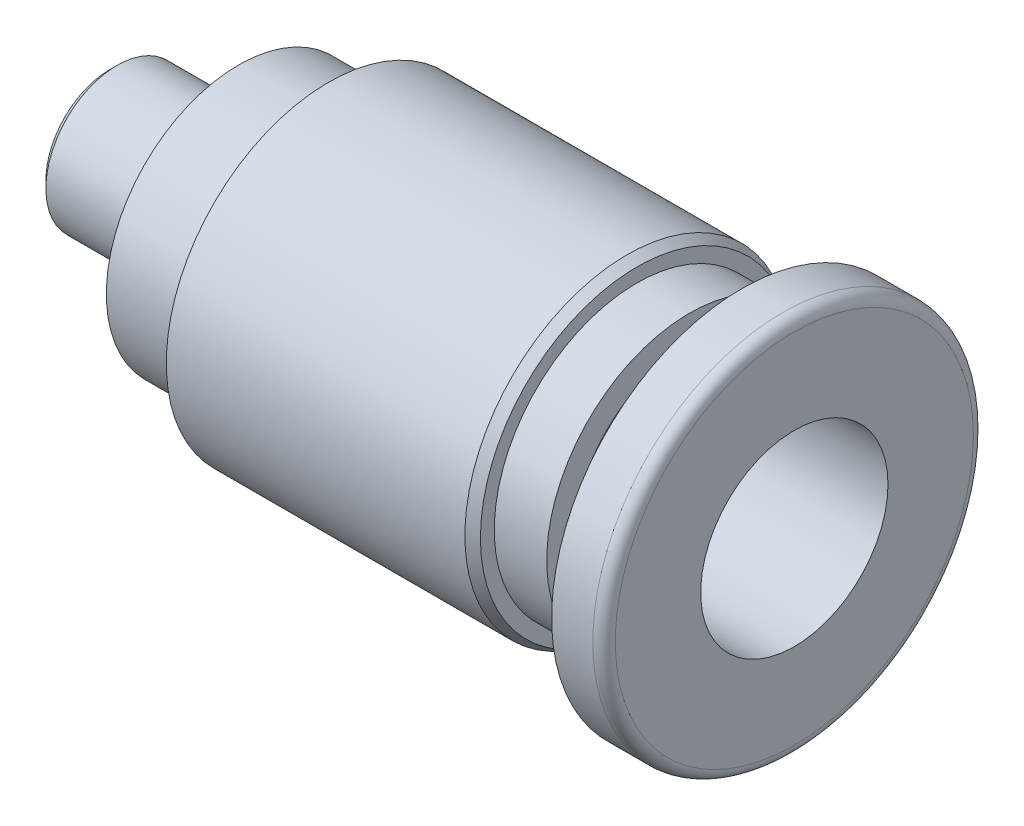
ISO-10303-21;
HEADER;
FILE_DESCRIPTION(('STEP AP214'),'2;1');
FILE_NAME('part.step','',(''),(''),'','','');
FILE_SCHEMA(('AUTOMOTIVE_DESIGN { 1 0 10303 214 1 1 1 1 }'));
ENDSEC;
DATA;
#1=APPLICATION_CONTEXT('core data for automotive mechanical design processes');
#2=APPLICATION_PROTOCOL_DEFINITION('international standard','automotive_design',2000,#1);
#3=PRODUCT_CONTEXT('',#1,'mechanical');
#4=PRODUCT('Part','Part','',(#3));
#5=PRODUCT_RELATED_PRODUCT_CATEGORY('part','',(#4));
#6=PRODUCT_DEFINITION_FORMATION('','',#4);
#7=PRODUCT_DEFINITION_CONTEXT('part definition',#1,'design');
#8=PRODUCT_DEFINITION('design','',#6,#7);
#9=PRODUCT_DEFINITION_SHAPE('','',#8);
#10=(LENGTH_UNIT() NAMED_UNIT(*) SI_UNIT(.MILLI.,.METRE.));
#11=(NAMED_UNIT(*) PLANE_ANGLE_UNIT() SI_UNIT($,.RADIAN.));
#12=(NAMED_UNIT(*) SI_UNIT($,.STERADIAN.) SOLID_ANGLE_UNIT());
#13=UNCERTAINTY_MEASURE_WITH_UNIT(LENGTH_MEASURE(1.E-05),#10,'distance_accuracy_value','');
#14=(GEOMETRIC_REPRESENTATION_CONTEXT(3) GLOBAL_UNCERTAINTY_ASSIGNED_CONTEXT((#13)) GLOBAL_UNIT_ASSIGNED_CONTEXT((#10,
#11,#12)) REPRESENTATION_CONTEXT('',''));
#15=CARTESIAN_POINT('',(0.,0.,0.));
#16=DIRECTION('',(0.,0.,1.));
#17=DIRECTION('',(1.,0.,0.));
#18=AXIS2_PLACEMENT_3D('',#15,#16,#17);
#19=CARTESIAN_POINT('',(5.9,3.175,0.));
#20=DIRECTION('',(1.,0.,0.));
#21=DIRECTION('',(0.,0.,-1.));
#22=AXIS2_PLACEMENT_3D('',#19,#20,#21);
#23=PLANE('',#22);
#24=CARTESIAN_POINT('',(5.9,0.,0.));
#25=DIRECTION('',(1.,0.,0.));
#26=DIRECTION('',(0.,0.,-1.));
#27=AXIS2_PLACEMENT_3D('',#24,#25,#26);
#28=CIRCLE('',#27,3.175);
#29=CARTESIAN_POINT('',(5.9,0.,-3.175));
#30=VERTEX_POINT('',#29);
#31=EDGE_CURVE('E119',#30,#30,#28,.T.);
#32=ORIENTED_EDGE('',*,*,#31,.T.);
#33=EDGE_LOOP('',(#32));
#34=FACE_BOUND('',#33,.T.);
#35=DIRECTION('',(0.,0.866025403784439,-0.5));
#36=VECTOR('',#35,1.);
#37=CARTESIAN_POINT('',(5.9,-1.190625,-0.687407664253898));
#38=LINE('',#37,#36);
#39=CARTESIAN_POINT('',(5.9,-1.190625,-0.687407664253898));
#40=VERTEX_POINT('',#39);
#41=CARTESIAN_POINT('',(5.9,0.,-1.3748153285078));
#42=VERTEX_POINT('',#41);
#43=EDGE_CURVE('E73',#40,#42,#38,.T.);
#44=ORIENTED_EDGE('',*,*,#43,.F.);
#45=DIRECTION('',(0.,0.,-1.));
#46=VECTOR('',#45,1.);
#47=CARTESIAN_POINT('',(5.9,-1.190625,0.687407664253899));
#48=LINE('',#47,#46);
#49=CARTESIAN_POINT('',(5.9,-1.190625,0.687407664253899));
#50=VERTEX_POINT('',#49);
#51=EDGE_CURVE('E79',#50,#40,#48,.T.);
#52=ORIENTED_EDGE('',*,*,#51,.F.);
#53=DIRECTION('',(0.,-0.866025403784439,-0.5));
#54=VECTOR('',#53,1.);
#55=CARTESIAN_POINT('',(5.9,0.,1.3748153285078));
#56=LINE('',#55,#54);
#57=CARTESIAN_POINT('',(5.9,0.,1.3748153285078));
#58=VERTEX_POINT('',#57);
#59=EDGE_CURVE('E85',#58,#50,#56,.T.);
#60=ORIENTED_EDGE('',*,*,#59,.F.);
#61=DIRECTION('',(0.,-0.866025403784438,0.5));
#62=VECTOR('',#61,1.);
#63=CARTESIAN_POINT('',(5.9,1.190625,0.687407664253899));
#64=LINE('',#63,#62);
#65=CARTESIAN_POINT('',(5.9,1.190625,0.687407664253899));
#66=VERTEX_POINT('',#65);
#67=EDGE_CURVE('E31',#66,#58,#64,.T.);
#68=ORIENTED_EDGE('',*,*,#67,.F.);
#69=DIRECTION('',(0.,0.,1.));
#70=VECTOR('',#69,1.);
#71=CARTESIAN_POINT('',(5.9,1.190625,-0.687407664253897));
#72=LINE('',#71,#70);
#73=CARTESIAN_POINT('',(5.9,1.190625,-0.687407664253897));
#74=VERTEX_POINT('',#73);
#75=EDGE_CURVE('E91',#74,#66,#72,.T.);
#76=ORIENTED_EDGE('',*,*,#75,.F.);
#77=DIRECTION('',(0.,0.866025403784439,0.5));
#78=VECTOR('',#77,1.);
#79=CARTESIAN_POINT('',(5.9,0.,-1.3748153285078));
#80=LINE('',#79,#78);
#81=EDGE_CURVE('E89',#42,#74,#80,.T.);
#82=ORIENTED_EDGE('',*,*,#81,.F.);
#83=EDGE_LOOP('',(#44,#52,#60,#68,#76,#82));
#84=FACE_BOUND('',#83,.T.);
#85=ADVANCED_FACE('F16',(#34,#84),#23,.T.);
#86=CARTESIAN_POINT('',(0.,0.,0.));
#87=DIRECTION('',(-1.,0.,0.));
#88=DIRECTION('',(0.,0.,1.));
#89=AXIS2_PLACEMENT_3D('',#86,#87,#88);
#90=PLANE('',#89);
#91=CARTESIAN_POINT('',(0.,0.,0.));
#92=DIRECTION('',(1.,0.,0.));
#93=DIRECTION('',(0.,0.,-1.));
#94=AXIS2_PLACEMENT_3D('',#91,#92,#93);
#95=CIRCLE('',#94,2.1717);
#96=CARTESIAN_POINT('',(0.,0.,-2.1717));
#97=VERTEX_POINT('',#96);
#98=EDGE_CURVE('E116',#97,#97,#95,.T.);
#99=ORIENTED_EDGE('',*,*,#98,.F.);
#100=EDGE_LOOP('',(#99));
#101=FACE_BOUND('',#100,.T.);
#102=DIRECTION('',(0.,-0.866025403784439,-0.5));
#103=VECTOR('',#102,1.);
#104=CARTESIAN_POINT('',(0.,0.,1.3748153285078));
#105=LINE('',#104,#103);
#106=CARTESIAN_POINT('',(0.,0.,1.3748153285078));
#107=VERTEX_POINT('',#106);
#108=CARTESIAN_POINT('',(0.,-1.190625,0.687407664253899));
#109=VERTEX_POINT('',#108);
#110=EDGE_CURVE('E95',#107,#109,#105,.T.);
#111=ORIENTED_EDGE('',*,*,#110,.T.);
#112=DIRECTION('',(0.,0.,-1.));
#113=VECTOR('',#112,1.);
#114=CARTESIAN_POINT('',(0.,-1.190625,0.687407664253899));
#115=LINE('',#114,#113);
#116=CARTESIAN_POINT('',(0.,-1.190625,-0.687407664253898));
#117=VERTEX_POINT('',#116);
#118=EDGE_CURVE('E39',#109,#117,#115,.T.);
#119=ORIENTED_EDGE('',*,*,#118,.T.);
#120=DIRECTION('',(0.,0.866025403784439,-0.5));
#121=VECTOR('',#120,1.);
#122=CARTESIAN_POINT('',(0.,-1.190625,-0.687407664253898));
#123=LINE('',#122,#121);
#124=CARTESIAN_POINT('',(0.,0.,-1.3748153285078));
#125=VERTEX_POINT('',#124);
#126=EDGE_CURVE('E76',#117,#125,#123,.T.);
#127=ORIENTED_EDGE('',*,*,#126,.T.);
#128=DIRECTION('',(0.,0.866025403784439,0.5));
#129=VECTOR('',#128,1.);
#130=CARTESIAN_POINT('',(0.,0.,-1.3748153285078));
#131=LINE('',#130,#129);
#132=CARTESIAN_POINT('',(0.,1.190625,-0.687407664253897));
#133=VERTEX_POINT('',#132);
#134=EDGE_CURVE('E99',#125,#133,#131,.T.);
#135=ORIENTED_EDGE('',*,*,#134,.T.);
#136=DIRECTION('',(0.,0.,1.));
#137=VECTOR('',#136,1.);
#138=CARTESIAN_POINT('',(0.,1.190625,-0.687407664253897));
#139=LINE('',#138,#137);
#140=CARTESIAN_POINT('',(0.,1.190625,0.687407664253899));
#141=VERTEX_POINT('',#140);
#142=EDGE_CURVE('E102',#133,#141,#139,.T.);
#143=ORIENTED_EDGE('',*,*,#142,.T.);
#144=DIRECTION('',(0.,-0.866025403784439,0.5));
#145=VECTOR('',#144,1.);
#146=CARTESIAN_POINT('',(0.,1.190625,0.687407664253899));
#147=LINE('',#146,#145);
#148=EDGE_CURVE('E105',#141,#107,#147,.T.);
#149=ORIENTED_EDGE('',*,*,#148,.T.);
#150=EDGE_LOOP('',(#111,#119,#127,#135,#143,#149));
#151=FACE_BOUND('',#150,.T.);
#152=ADVANCED_FACE('F165',(#101,#151),#90,.T.);
#153=CARTESIAN_POINT('',(17.866,0.,0.));
#154=DIRECTION('',(-1.,0.,0.));
#155=DIRECTION('',(0.,0.,1.));
#156=AXIS2_PLACEMENT_3D('',#153,#154,#155);
#157=CONICAL_SURFACE('',#156,5.3075,0.523598775598303);
#158=CARTESIAN_POINT('',(17.532580219543,0.,0.));
#159=DIRECTION('',(1.,0.,0.));
#160=DIRECTION('',(0.,0.,-1.));
#161=AXIS2_PLACEMENT_3D('',#158,#159,#160);
#162=CIRCLE('',#161,5.5);
#163=CARTESIAN_POINT('',(17.532580219543,0.,-5.5));
#164=VERTEX_POINT('',#163);
#165=EDGE_CURVE('E110',#164,#164,#162,.T.);
#166=ORIENTED_EDGE('',*,*,#165,.T.);
#167=EDGE_LOOP('',(#166));
#168=FACE_BOUND('',#167,.T.);
#169=CARTESIAN_POINT('',(17.866,0.,0.));
#170=DIRECTION('',(1.,0.,0.));
#171=DIRECTION('',(0.,0.,-1.));
#172=AXIS2_PLACEMENT_3D('',#169,#170,#171);
#173=CIRCLE('',#172,5.3075);
#174=CARTESIAN_POINT('',(17.866,0.,-5.3075));
#175=VERTEX_POINT('',#174);
#176=EDGE_CURVE('E140',#175,#175,#173,.T.);
#177=ORIENTED_EDGE('',*,*,#176,.F.);
#178=EDGE_LOOP('',(#177));
#179=FACE_BOUND('',#178,.T.);
#180=ADVANCED_FACE('F171',(#168,#179),#157,.T.);
#181=CARTESIAN_POINT('',(17.866,5.3075,0.));
#182=DIRECTION('',(1.,0.,0.));
#183=DIRECTION('',(0.,0.,-1.));
#184=AXIS2_PLACEMENT_3D('',#181,#182,#183);
#185=PLANE('',#184);
#186=ORIENTED_EDGE('',*,*,#176,.T.);
#187=EDGE_LOOP('',(#186));
#188=FACE_BOUND('',#187,.T.);
#189=CARTESIAN_POINT('',(17.866,0.,0.));
#190=DIRECTION('',(1.,0.,0.));
#191=DIRECTION('',(0.,0.,-1.));
#192=AXIS2_PLACEMENT_3D('',#189,#190,#191);
#193=CIRCLE('',#192,4.8375);
#194=CARTESIAN_POINT('',(17.866,0.,-4.8375));
#195=VERTEX_POINT('',#194);
#196=EDGE_CURVE('E137',#195,#195,#193,.T.);
#197=ORIENTED_EDGE('',*,*,#196,.F.);
#198=EDGE_LOOP('',(#197));
#199=FACE_BOUND('',#198,.T.);
#200=ADVANCED_FACE('F202',(#188,#199),#185,.T.);
#201=CARTESIAN_POINT('',(0.,0.,0.));
#202=DIRECTION('',(1.,0.,0.));
#203=DIRECTION('',(0.,0.,-1.));
#204=AXIS2_PLACEMENT_3D('',#201,#202,#203);
#205=CYLINDRICAL_SURFACE('',#204,4.8375);
#206=ORIENTED_EDGE('',*,*,#196,.T.);
#207=EDGE_LOOP('',(#206));
#208=FACE_BOUND('',#207,.T.);
#209=CARTESIAN_POINT('',(19.644,0.,0.));
#210=DIRECTION('',(1.,0.,0.));
#211=DIRECTION('',(0.,0.,-1.));
#212=AXIS2_PLACEMENT_3D('',#209,#210,#211);
#213=CIRCLE('',#212,4.8375);
#214=CARTESIAN_POINT('',(19.644,0.,-4.8375));
#215=VERTEX_POINT('',#214);
#216=EDGE_CURVE('E134',#215,#215,#213,.T.);
#217=ORIENTED_EDGE('',*,*,#216,.F.);
#218=EDGE_LOOP('',(#217));
#219=FACE_BOUND('',#218,.T.);
#220=ADVANCED_FACE('F198',(#208,#219),#205,.T.);
#221=CARTESIAN_POINT('',(19.644,4.8375,0.));
#222=DIRECTION('',(1.,0.,0.));
#223=DIRECTION('',(0.,0.,-1.));
#224=AXIS2_PLACEMENT_3D('',#221,#222,#223);
#225=PLANE('',#224);
#226=ORIENTED_EDGE('',*,*,#216,.T.);
#227=EDGE_LOOP('',(#226));
#228=FACE_BOUND('',#227,.T.);
#229=CARTESIAN_POINT('',(19.644,0.,0.));
#230=DIRECTION('',(1.,0.,0.));
#231=DIRECTION('',(0.,0.,-1.));
#232=AXIS2_PLACEMENT_3D('',#229,#230,#231);
#233=CIRCLE('',#232,3.96875);
#234=CARTESIAN_POINT('',(19.644,0.,-3.96875));
#235=VERTEX_POINT('',#234);
#236=EDGE_CURVE('E131',#235,#235,#233,.T.);
#237=ORIENTED_EDGE('',*,*,#236,.F.);
#238=EDGE_LOOP('',(#237));
#239=FACE_BOUND('',#238,.T.);
#240=ADVANCED_FACE('F194',(#228,#239),#225,.T.);
#241=CARTESIAN_POINT('',(0.,0.,0.));
#242=DIRECTION('',(1.,0.,0.));
#243=DIRECTION('',(0.,0.,-1.));
#244=AXIS2_PLACEMENT_3D('',#241,#242,#243);
#245=CYLINDRICAL_SURFACE('',#244,3.96875);
#246=ORIENTED_EDGE('',*,*,#236,.T.);
#247=EDGE_LOOP('',(#246));
#248=FACE_BOUND('',#247,.T.);
#249=CARTESIAN_POINT('',(21.422,0.,0.));
#250=DIRECTION('',(1.,0.,0.));
#251=DIRECTION('',(0.,0.,-1.));
#252=AXIS2_PLACEMENT_3D('',#249,#250,#251);
#253=CIRCLE('',#252,3.96875);
#254=CARTESIAN_POINT('',(21.422,0.,-3.96875));
#255=VERTEX_POINT('',#254);
#256=EDGE_CURVE('E128',#255,#255,#253,.T.);
#257=ORIENTED_EDGE('',*,*,#256,.F.);
#258=EDGE_LOOP('',(#257));
#259=FACE_BOUND('',#258,.T.);
#260=ADVANCED_FACE('F190',(#248,#259),#245,.T.);
#261=CARTESIAN_POINT('',(21.422,3.96875,0.));
#262=DIRECTION('',(-1.,0.,0.));
#263=DIRECTION('',(0.,0.,1.));
#264=AXIS2_PLACEMENT_3D('',#261,#262,#263);
#265=PLANE('',#264);
#266=ORIENTED_EDGE('',*,*,#256,.T.);
#267=EDGE_LOOP('',(#266));
#268=FACE_BOUND('',#267,.T.);
#269=CARTESIAN_POINT('',(21.422,0.,0.));
#270=DIRECTION('',(1.,0.,0.));
#271=DIRECTION('',(0.,0.,-1.));
#272=AXIS2_PLACEMENT_3D('',#269,#270,#271);
#273=CIRCLE('',#272,6.45);
#274=CARTESIAN_POINT('',(21.422,0.,-6.45));
#275=VERTEX_POINT('',#274);
#276=EDGE_CURVE('E125',#275,#275,#273,.T.);
#277=ORIENTED_EDGE('',*,*,#276,.F.);
#278=EDGE_LOOP('',(#277));
#279=FACE_BOUND('',#278,.T.);
#280=ADVANCED_FACE('F186',(#268,#279),#265,.T.);
#281=CARTESIAN_POINT('',(0.,0.,0.));
#282=DIRECTION('',(1.,0.,0.));
#283=DIRECTION('',(0.,0.,-1.));
#284=AXIS2_PLACEMENT_3D('',#281,#282,#283);
#285=CYLINDRICAL_SURFACE('',#284,6.45);
#286=CARTESIAN_POINT('',(22.819,0.,0.));
#287=DIRECTION('',(1.,0.,0.));
#288=DIRECTION('',(0.,0.,-1.));
#289=AXIS2_PLACEMENT_3D('',#286,#287,#288);
#290=CIRCLE('',#289,6.45);
#291=CARTESIAN_POINT('',(22.819,0.,-6.45));
#292=VERTEX_POINT('',#291);
#293=EDGE_CURVE('E11',#292,#292,#290,.F.);
#294=ORIENTED_EDGE('',*,*,#293,.T.);
#295=EDGE_LOOP('',(#294));
#296=FACE_BOUND('',#295,.T.);
#297=ORIENTED_EDGE('',*,*,#276,.T.);
#298=EDGE_LOOP('',(#297));
#299=FACE_BOUND('',#298,.T.);
#300=ADVANCED_FACE('F183',(#296,#299),#285,.T.);
#301=CARTESIAN_POINT('',(23.2,6.45,0.));
#302=DIRECTION('',(1.,0.,0.));
#303=DIRECTION('',(0.,0.,-1.));
#304=AXIS2_PLACEMENT_3D('',#301,#302,#303);
#305=PLANE('',#304);
#306=CARTESIAN_POINT('',(23.2,0.,0.));
#307=DIRECTION('',(1.,0.,0.));
#308=DIRECTION('',(0.,0.,-1.));
#309=AXIS2_PLACEMENT_3D('',#306,#307,#308);
#310=CIRCLE('',#309,6.069);
#311=CARTESIAN_POINT('',(23.2,0.,-6.069));
#312=VERTEX_POINT('',#311);
#313=EDGE_CURVE('E24',#312,#312,#310,.T.);
#314=ORIENTED_EDGE('',*,*,#313,.T.);
#315=EDGE_LOOP('',(#314));
#316=FACE_BOUND('',#315,.T.);
#317=CARTESIAN_POINT('',(23.2,0.,0.));
#318=DIRECTION('',(1.,0.,0.));
#319=DIRECTION('',(0.,0.,-1.));
#320=AXIS2_PLACEMENT_3D('',#317,#318,#319);
#321=CIRCLE('',#320,3.175);
#322=CARTESIAN_POINT('',(23.2,0.,-3.175));
#323=VERTEX_POINT('',#322);
#324=EDGE_CURVE('E122',#323,#323,#321,.T.);
#325=ORIENTED_EDGE('',*,*,#324,.F.);
#326=EDGE_LOOP('',(#325));
#327=FACE_BOUND('',#326,.T.);
#328=ADVANCED_FACE('F145',(#316,#327),#305,.T.);
#329=CARTESIAN_POINT('',(0.,0.,0.));
#330=DIRECTION('',(1.,0.,0.));
#331=DIRECTION('',(0.,0.,-1.));
#332=AXIS2_PLACEMENT_3D('',#329,#330,#331);
#333=CYLINDRICAL_SURFACE('',#332,3.175);
#334=ORIENTED_EDGE('',*,*,#324,.T.);
#335=EDGE_LOOP('',(#334));
#336=FACE_BOUND('',#335,.T.);
#337=ORIENTED_EDGE('',*,*,#31,.F.);
#338=EDGE_LOOP('',(#337));
#339=FACE_BOUND('',#338,.T.);
#340=ADVANCED_FACE('F176',(#336,#339),#333,.F.);
#341=CARTESIAN_POINT('',(0.241300000000002,0.,0.));
#342=DIRECTION('',(1.,0.,0.));
#343=DIRECTION('',(0.,0.,-1.));
#344=AXIS2_PLACEMENT_3D('',#341,#342,#343);
#345=CONICAL_SURFACE('',#344,2.413,0.785398163397442);
#346=ORIENTED_EDGE('',*,*,#98,.T.);
#347=EDGE_LOOP('',(#346));
#348=FACE_BOUND('',#347,.T.);
#349=CARTESIAN_POINT('',(0.241300000000002,0.,0.));
#350=DIRECTION('',(1.,0.,0.));
#351=DIRECTION('',(0.,0.,-1.));
#352=AXIS2_PLACEMENT_3D('',#349,#350,#351);
#353=CIRCLE('',#352,2.413);
#354=CARTESIAN_POINT('',(0.241300000000002,0.,-2.413));
#355=VERTEX_POINT('',#354);
#356=EDGE_CURVE('E113',#355,#355,#353,.T.);
#357=ORIENTED_EDGE('',*,*,#356,.F.);
#358=EDGE_LOOP('',(#357));
#359=FACE_BOUND('',#358,.T.);
#360=ADVANCED_FACE('F179',(#348,#359),#345,.T.);
#361=CARTESIAN_POINT('',(0.,0.,0.));
#362=DIRECTION('',(1.,0.,0.));
#363=DIRECTION('',(0.,0.,-1.));
#364=AXIS2_PLACEMENT_3D('',#361,#362,#363);
#365=CYLINDRICAL_SURFACE('',#364,2.413);
#366=ORIENTED_EDGE('',*,*,#356,.T.);
#367=EDGE_LOOP('',(#366));
#368=FACE_BOUND('',#367,.T.);
#369=CARTESIAN_POINT('',(3.6,0.,0.));
#370=DIRECTION('',(1.,0.,0.));
#371=DIRECTION('',(0.,0.,-1.));
#372=AXIS2_PLACEMENT_3D('',#369,#370,#371);
#373=CIRCLE('',#372,2.413);
#374=CARTESIAN_POINT('',(3.6,0.,-2.413));
#375=VERTEX_POINT('',#374);
#376=EDGE_CURVE('E109',#375,#375,#373,.T.);
#377=ORIENTED_EDGE('',*,*,#376,.F.);
#378=EDGE_LOOP('',(#377));
#379=FACE_BOUND('',#378,.T.);
#380=ADVANCED_FACE('F228',(#368,#379),#365,.T.);
#381=CARTESIAN_POINT('',(0.,0.,0.));
#382=DIRECTION('',(1.,0.,0.));
#383=DIRECTION('',(0.,0.,-1.));
#384=AXIS2_PLACEMENT_3D('',#381,#382,#383);
#385=CYLINDRICAL_SURFACE('',#384,5.5);
#386=ORIENTED_EDGE('',*,*,#165,.F.);
#387=EDGE_LOOP('',(#386));
#388=FACE_BOUND('',#387,.T.);
#389=CARTESIAN_POINT('',(7.41,0.,0.));
#390=DIRECTION('',(1.,0.,0.));
#391=DIRECTION('',(0.,0.,-1.));
#392=AXIS2_PLACEMENT_3D('',#389,#390,#391);
#393=CIRCLE('',#392,5.5);
#394=CARTESIAN_POINT('',(7.41,0.,-5.5));
#395=VERTEX_POINT('',#394);
#396=EDGE_CURVE('E232',#395,#395,#393,.T.);
#397=ORIENTED_EDGE('',*,*,#396,.T.);
#398=EDGE_LOOP('',(#397));
#399=FACE_BOUND('',#398,.T.);
#400=ADVANCED_FACE('F225',(#388,#399),#385,.T.);
#401=CARTESIAN_POINT('',(9.5374194578712,-1.190625,0.687407664253899));
#402=DIRECTION('',(0.,1.,0.));
#403=DIRECTION('',(0.,0.,1.));
#404=AXIS2_PLACEMENT_3D('',#401,#402,#403);
#405=PLANE('',#404);
#406=ORIENTED_EDGE('',*,*,#51,.T.);
#407=DIRECTION('',(-1.,0.,0.));
#408=VECTOR('',#407,1.);
#409=CARTESIAN_POINT('',(9.5374194578712,-1.190625,-0.687407664253898));
#410=LINE('',#409,#408);
#411=EDGE_CURVE('E69',#40,#117,#410,.T.);
#412=ORIENTED_EDGE('',*,*,#411,.T.);
#413=ORIENTED_EDGE('',*,*,#118,.F.);
#414=DIRECTION('',(-1.,0.,0.));
#415=VECTOR('',#414,1.);
#416=CARTESIAN_POINT('',(9.5374194578712,-1.190625,0.687407664253899));
#417=LINE('',#416,#415);
#418=EDGE_CURVE('E81',#50,#109,#417,.T.);
#419=ORIENTED_EDGE('',*,*,#418,.F.);
#420=EDGE_LOOP('',(#406,#412,#413,#419));
#421=FACE_BOUND('',#420,.T.);
#422=ADVANCED_FACE('F80',(#421),#405,.T.);
#423=CARTESIAN_POINT('',(9.5374194578712,-1.190625,-0.687407664253898));
#424=DIRECTION('',(0.,0.5,0.866025403784439));
#425=DIRECTION('',(0.,-0.866025403784439,0.5));
#426=AXIS2_PLACEMENT_3D('',#423,#424,#425);
#427=PLANE('',#426);
#428=ORIENTED_EDGE('',*,*,#43,.T.);
#429=DIRECTION('',(-1.,0.,0.));
#430=VECTOR('',#429,1.);
#431=CARTESIAN_POINT('',(9.5374194578712,0.,-1.3748153285078));
#432=LINE('',#431,#430);
#433=EDGE_CURVE('E97',#42,#125,#432,.T.);
#434=ORIENTED_EDGE('',*,*,#433,.T.);
#435=ORIENTED_EDGE('',*,*,#126,.F.);
#436=ORIENTED_EDGE('',*,*,#411,.F.);
#437=EDGE_LOOP('',(#428,#434,#435,#436));
#438=FACE_BOUND('',#437,.T.);
#439=ADVANCED_FACE('F71',(#438),#427,.T.);
#440=CARTESIAN_POINT('',(9.5374194578712,0.,-1.3748153285078));
#441=DIRECTION('',(0.,-0.5,0.866025403784438));
#442=DIRECTION('',(0.,-0.866025403784439,-0.5));
#443=AXIS2_PLACEMENT_3D('',#440,#441,#442);
#444=PLANE('',#443);
#445=ORIENTED_EDGE('',*,*,#81,.T.);
#446=DIRECTION('',(-1.,0.,0.));
#447=VECTOR('',#446,1.);
#448=CARTESIAN_POINT('',(9.5374194578712,1.190625,-0.687407664253897));
#449=LINE('',#448,#447);
#450=EDGE_CURVE('E100',#74,#133,#449,.T.);
#451=ORIENTED_EDGE('',*,*,#450,.T.);
#452=ORIENTED_EDGE('',*,*,#134,.F.);
#453=ORIENTED_EDGE('',*,*,#433,.F.);
#454=EDGE_LOOP('',(#445,#451,#452,#453));
#455=FACE_BOUND('',#454,.T.);
#456=ADVANCED_FACE('F269',(#455),#444,.T.);
#457=CARTESIAN_POINT('',(9.5374194578712,1.190625,-0.687407664253897));
#458=DIRECTION('',(0.,-1.,0.));
#459=DIRECTION('',(0.,0.,-1.));
#460=AXIS2_PLACEMENT_3D('',#457,#458,#459);
#461=PLANE('',#460);
#462=ORIENTED_EDGE('',*,*,#75,.T.);
#463=DIRECTION('',(-1.,0.,0.));
#464=VECTOR('',#463,1.);
#465=CARTESIAN_POINT('',(9.5374194578712,1.190625,0.687407664253899));
#466=LINE('',#465,#464);
#467=EDGE_CURVE('E103',#66,#141,#466,.T.);
#468=ORIENTED_EDGE('',*,*,#467,.T.);
#469=ORIENTED_EDGE('',*,*,#142,.F.);
#470=ORIENTED_EDGE('',*,*,#450,.F.);
#471=EDGE_LOOP('',(#462,#468,#469,#470));
#472=FACE_BOUND('',#471,.T.);
#473=ADVANCED_FACE('F262',(#472),#461,.T.);
#474=CARTESIAN_POINT('',(9.5374194578712,1.190625,0.687407664253899));
#475=DIRECTION('',(0.,-0.5,-0.866025403784439));
#476=DIRECTION('',(0.,0.866025403784438,-0.5));
#477=AXIS2_PLACEMENT_3D('',#474,#475,#476);
#478=PLANE('',#477);
#479=ORIENTED_EDGE('',*,*,#67,.T.);
#480=DIRECTION('',(-1.,0.,0.));
#481=VECTOR('',#480,1.);
#482=CARTESIAN_POINT('',(9.5374194578712,0.,1.3748153285078));
#483=LINE('',#482,#481);
#484=EDGE_CURVE('E106',#58,#107,#483,.T.);
#485=ORIENTED_EDGE('',*,*,#484,.T.);
#486=ORIENTED_EDGE('',*,*,#148,.F.);
#487=ORIENTED_EDGE('',*,*,#467,.F.);
#488=EDGE_LOOP('',(#479,#485,#486,#487));
#489=FACE_BOUND('',#488,.T.);
#490=ADVANCED_FACE('F160',(#489),#478,.T.);
#491=CARTESIAN_POINT('',(9.5374194578712,0.,1.3748153285078));
#492=DIRECTION('',(0.,0.5,-0.866025403784439));
#493=DIRECTION('',(0.,0.866025403784439,0.5));
#494=AXIS2_PLACEMENT_3D('',#491,#492,#493);
#495=PLANE('',#494);
#496=ORIENTED_EDGE('',*,*,#59,.T.);
#497=ORIENTED_EDGE('',*,*,#418,.T.);
#498=ORIENTED_EDGE('',*,*,#110,.F.);
#499=ORIENTED_EDGE('',*,*,#484,.F.);
#500=EDGE_LOOP('',(#496,#497,#498,#499));
#501=FACE_BOUND('',#500,.T.);
#502=ADVANCED_FACE('F150',(#501),#495,.T.);
#503=CARTESIAN_POINT('',(22.819,0.,0.));
#504=DIRECTION('',(1.,0.,0.));
#505=DIRECTION('',(0.,0.,-1.));
#506=AXIS2_PLACEMENT_3D('',#503,#504,#505);
#507=TOROIDAL_SURFACE('',#506,6.069,0.381);
#508=ORIENTED_EDGE('',*,*,#293,.F.);
#509=EDGE_LOOP('',(#508));
#510=FACE_BOUND('',#509,.T.);
#511=ORIENTED_EDGE('',*,*,#313,.F.);
#512=EDGE_LOOP('',(#511));
#513=FACE_BOUND('',#512,.T.);
#514=ADVANCED_FACE('F18',(#510,#513),#507,.T.);
#515=CARTESIAN_POINT('',(3.6,0.,0.));
#516=DIRECTION('',(-1.,0.,0.));
#517=DIRECTION('',(0.,0.,1.));
#518=AXIS2_PLACEMENT_3D('',#515,#516,#517);
#519=CONICAL_SURFACE('',#518,2.413,0.785398163397443);
#520=CARTESIAN_POINT('',(3.98100000000001,0.,0.));
#521=DIRECTION('',(1.,0.,0.));
#522=DIRECTION('',(0.,0.,-1.));
#523=AXIS2_PLACEMENT_3D('',#520,#521,#522);
#524=CIRCLE('',#523,2.032);
#525=CARTESIAN_POINT('',(3.98100000000001,0.,-2.032));
#526=VERTEX_POINT('',#525);
#527=EDGE_CURVE('E245',#526,#526,#524,.T.);
#528=ORIENTED_EDGE('',*,*,#527,.F.);
#529=EDGE_LOOP('',(#528));
#530=FACE_BOUND('',#529,.T.);
#531=ORIENTED_EDGE('',*,*,#376,.T.);
#532=EDGE_LOOP('',(#531));
#533=FACE_BOUND('',#532,.T.);
#534=ADVANCED_FACE('F149',(#530,#533),#519,.T.);
#535=CARTESIAN_POINT('',(0.,0.,0.));
#536=DIRECTION('',(1.,0.,0.));
#537=DIRECTION('',(0.,0.,-1.));
#538=AXIS2_PLACEMENT_3D('',#535,#536,#537);
#539=CYLINDRICAL_SURFACE('',#538,2.032);
#540=CARTESIAN_POINT('',(4.362,0.,0.));
#541=DIRECTION('',(1.,0.,0.));
#542=DIRECTION('',(0.,0.,-1.));
#543=AXIS2_PLACEMENT_3D('',#540,#541,#542);
#544=CIRCLE('',#543,2.032);
#545=CARTESIAN_POINT('',(4.362,0.,-2.032));
#546=VERTEX_POINT('',#545);
#547=EDGE_CURVE('E242',#546,#546,#544,.T.);
#548=ORIENTED_EDGE('',*,*,#547,.F.);
#549=EDGE_LOOP('',(#548));
#550=FACE_BOUND('',#549,.T.);
#551=ORIENTED_EDGE('',*,*,#527,.T.);
#552=EDGE_LOOP('',(#551));
#553=FACE_BOUND('',#552,.T.);
#554=ADVANCED_FACE('F157',(#550,#553),#539,.T.);
#555=CARTESIAN_POINT('',(4.362,4.484,0.));
#556=DIRECTION('',(1.,0.,0.));
#557=DIRECTION('',(0.,0.,-1.));
#558=AXIS2_PLACEMENT_3D('',#555,#556,#557);
#559=PLANE('',#558);
#560=CARTESIAN_POINT('',(4.362,0.,0.));
#561=DIRECTION('',(1.,0.,0.));
#562=DIRECTION('',(0.,0.,-1.));
#563=AXIS2_PLACEMENT_3D('',#560,#561,#562);
#564=CIRCLE('',#563,4.484);
#565=CARTESIAN_POINT('',(4.362,0.,-4.484));
#566=VERTEX_POINT('',#565);
#567=EDGE_CURVE('E237',#566,#566,#564,.T.);
#568=ORIENTED_EDGE('',*,*,#567,.F.);
#569=EDGE_LOOP('',(#568));
#570=FACE_BOUND('',#569,.T.);
#571=ORIENTED_EDGE('',*,*,#547,.T.);
#572=EDGE_LOOP('',(#571));
#573=FACE_BOUND('',#572,.T.);
#574=ADVANCED_FACE('F365',(#570,#573),#559,.F.);
#575=CARTESIAN_POINT('',(0.,0.,0.));
#576=DIRECTION('',(1.,0.,0.));
#577=DIRECTION('',(0.,0.,-1.));
#578=AXIS2_PLACEMENT_3D('',#575,#576,#577);
#579=CYLINDRICAL_SURFACE('',#578,4.484);
#580=CARTESIAN_POINT('',(7.41,0.,0.));
#581=DIRECTION('',(1.,0.,0.));
#582=DIRECTION('',(0.,0.,-1.));
#583=AXIS2_PLACEMENT_3D('',#580,#581,#582);
#584=CIRCLE('',#583,4.484);
#585=CARTESIAN_POINT('',(7.41,0.,-4.484));
#586=VERTEX_POINT('',#585);
#587=EDGE_CURVE('E234',#586,#586,#584,.T.);
#588=ORIENTED_EDGE('',*,*,#587,.F.);
#589=EDGE_LOOP('',(#588));
#590=FACE_BOUND('',#589,.T.);
#591=ORIENTED_EDGE('',*,*,#567,.T.);
#592=EDGE_LOOP('',(#591));
#593=FACE_BOUND('',#592,.T.);
#594=ADVANCED_FACE('F375',(#590,#593),#579,.T.);
#595=CARTESIAN_POINT('',(7.41,5.5,0.));
#596=DIRECTION('',(1.,0.,0.));
#597=DIRECTION('',(0.,0.,-1.));
#598=AXIS2_PLACEMENT_3D('',#595,#596,#597);
#599=PLANE('',#598);
#600=ORIENTED_EDGE('',*,*,#396,.F.);
#601=EDGE_LOOP('',(#600));
#602=FACE_BOUND('',#601,.T.);
#603=ORIENTED_EDGE('',*,*,#587,.T.);
#604=EDGE_LOOP('',(#603));
#605=FACE_BOUND('',#604,.T.);
#606=ADVANCED_FACE('F385',(#602,#605),#599,.F.);
#607=CLOSED_SHELL('',(#85,#152,#180,#200,#220,#240,#260,#280,#300,#328,#340,#360,#380,#400,#422,
#439,#456,#473,#490,#502,#514,#534,#554,#574,#594,#606));
#608=MANIFOLD_SOLID_BREP('B1',#607);
#609=ADVANCED_BREP_SHAPE_REPRESENTATION('',(#18,#608),#14);
#610=SHAPE_DEFINITION_REPRESENTATION(#9,#609);
ENDSEC;
END-ISO-10303-21;
